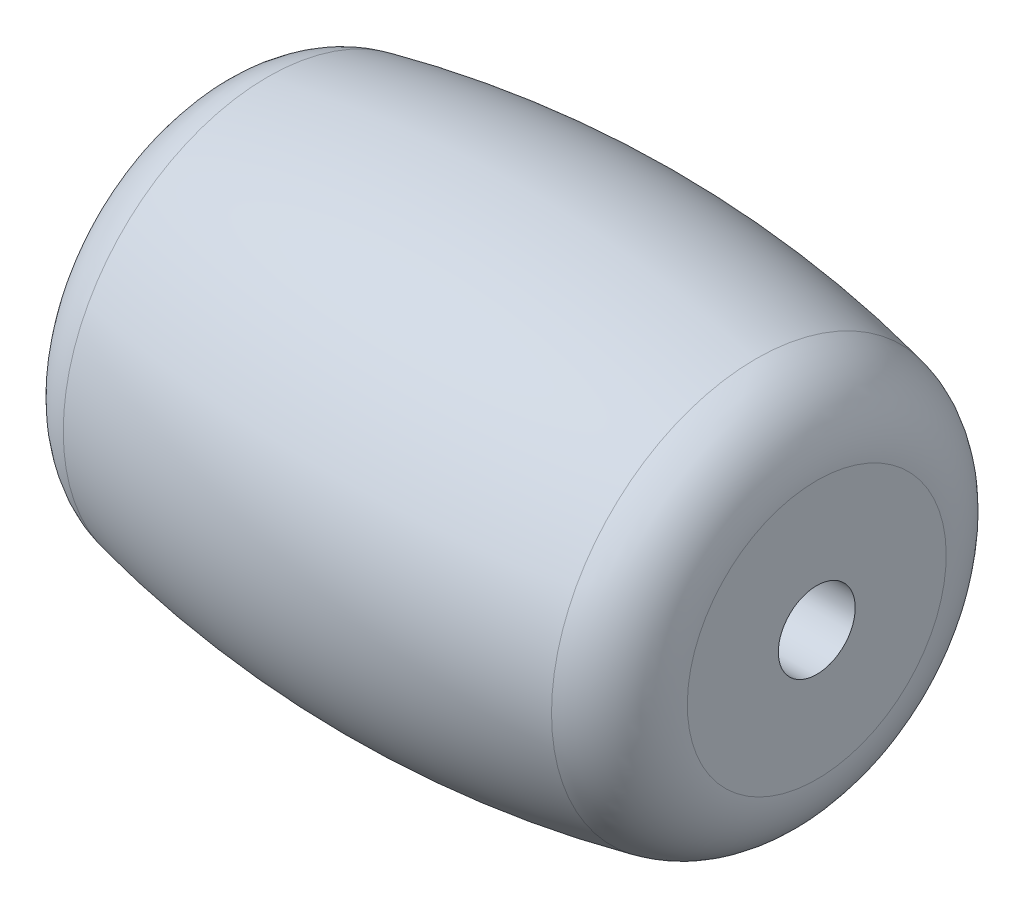
ISO-10303-21;
HEADER;
FILE_DESCRIPTION(('STEP AP214'),'2;1');
FILE_NAME('part.step','',(''),(''),'','','');
FILE_SCHEMA(('AUTOMOTIVE_DESIGN { 1 0 10303 214 1 1 1 1 }'));
ENDSEC;
DATA;
#1=APPLICATION_CONTEXT('core data for automotive mechanical design processes');
#2=APPLICATION_PROTOCOL_DEFINITION('international standard','automotive_design',2000,#1);
#3=PRODUCT_CONTEXT('',#1,'mechanical');
#4=PRODUCT('Part','Part','',(#3));
#5=PRODUCT_RELATED_PRODUCT_CATEGORY('part','',(#4));
#6=PRODUCT_DEFINITION_FORMATION('','',#4);
#7=PRODUCT_DEFINITION_CONTEXT('part definition',#1,'design');
#8=PRODUCT_DEFINITION('design','',#6,#7);
#9=PRODUCT_DEFINITION_SHAPE('','',#8);
#10=(LENGTH_UNIT() NAMED_UNIT(*) SI_UNIT(.MILLI.,.METRE.));
#11=(NAMED_UNIT(*) PLANE_ANGLE_UNIT() SI_UNIT($,.RADIAN.));
#12=(NAMED_UNIT(*) SI_UNIT($,.STERADIAN.) SOLID_ANGLE_UNIT());
#13=UNCERTAINTY_MEASURE_WITH_UNIT(LENGTH_MEASURE(1.E-05),#10,'distance_accuracy_value','');
#14=(GEOMETRIC_REPRESENTATION_CONTEXT(3) GLOBAL_UNCERTAINTY_ASSIGNED_CONTEXT((#13)) GLOBAL_UNIT_ASSIGNED_CONTEXT((#10,
#11,#12)) REPRESENTATION_CONTEXT('',''));
#15=CARTESIAN_POINT('',(0.,0.,0.));
#16=DIRECTION('',(0.,0.,1.));
#17=DIRECTION('',(1.,0.,0.));
#18=AXIS2_PLACEMENT_3D('',#15,#16,#17);
#19=CARTESIAN_POINT('',(0.,0.,0.));
#20=DIRECTION('',(-1.,0.,0.));
#21=DIRECTION('',(0.,-1.,0.));
#22=AXIS2_PLACEMENT_3D('',#19,#20,#21);
#23=DEGENERATE_TOROIDAL_SURFACE('',#22,24.,30.,.F.);
#24=CARTESIAN_POINT('',(-6.34821428571429,0.,0.));
#25=DIRECTION('',(1.,0.,0.));
#26=DIRECTION('',(0.,1.,0.));
#27=AXIS2_PLACEMENT_3D('',#24,#25,#26);
#28=CIRCLE('',#27,5.32064418430558);
#29=CARTESIAN_POINT('',(-6.34821428571429,5.32064418430558,0.));
#30=VERTEX_POINT('',#29);
#31=EDGE_CURVE('E10',#30,#30,#28,.T.);
#32=ORIENTED_EDGE('',*,*,#31,.T.);
#33=EDGE_LOOP('',(#32));
#34=FACE_BOUND('',#33,.T.);
#35=CARTESIAN_POINT('',(6.34821428571429,0.,0.));
#36=DIRECTION('',(-1.,0.,0.));
#37=DIRECTION('',(0.,-1.,0.));
#38=AXIS2_PLACEMENT_3D('',#35,#36,#37);
#39=CIRCLE('',#38,5.32064418430558);
#40=CARTESIAN_POINT('',(6.34821428571429,-5.32064418430558,0.));
#41=VERTEX_POINT('',#40);
#42=EDGE_CURVE('E45',#41,#41,#39,.T.);
#43=ORIENTED_EDGE('',*,*,#42,.T.);
#44=EDGE_LOOP('',(#43));
#45=FACE_BOUND('',#44,.T.);
#46=ADVANCED_FACE('F30',(#34,#45),#23,.F.);
#47=CARTESIAN_POINT('',(7.925,4.93431137939867,0.));
#48=DIRECTION('',(1.,0.,0.));
#49=DIRECTION('',(0.,1.,0.));
#50=AXIS2_PLACEMENT_3D('',#47,#48,#49);
#51=PLANE('',#50);
#52=CARTESIAN_POINT('',(7.925,0.,0.));
#53=DIRECTION('',(1.,0.,0.));
#54=DIRECTION('',(0.,0.,-1.));
#55=AXIS2_PLACEMENT_3D('',#52,#53,#54);
#56=CIRCLE('',#55,0.999999999999987);
#57=CARTESIAN_POINT('',(7.925,0.,-0.999999999999989));
#58=VERTEX_POINT('',#57);
#59=EDGE_CURVE('E53',#58,#58,#56,.T.);
#60=ORIENTED_EDGE('',*,*,#59,.F.);
#61=EDGE_LOOP('',(#60));
#62=FACE_BOUND('',#61,.T.);
#63=CARTESIAN_POINT('',(7.925,0.,0.));
#64=DIRECTION('',(1.,0.,0.));
#65=DIRECTION('',(0.,1.,0.));
#66=AXIS2_PLACEMENT_3D('',#63,#64,#65);
#67=CIRCLE('',#66,3.36593457201854);
#68=CARTESIAN_POINT('',(7.925,3.36593457201854,0.));
#69=VERTEX_POINT('',#68);
#70=EDGE_CURVE('E41',#69,#69,#67,.T.);
#71=ORIENTED_EDGE('',*,*,#70,.T.);
#72=EDGE_LOOP('',(#71));
#73=FACE_BOUND('',#72,.T.);
#74=ADVANCED_FACE('F59',(#62,#73),#51,.T.);
#75=CARTESIAN_POINT('',(-7.925,0.,0.));
#76=DIRECTION('',(-1.,0.,0.));
#77=DIRECTION('',(0.,-1.,0.));
#78=AXIS2_PLACEMENT_3D('',#75,#76,#77);
#79=PLANE('',#78);
#80=CARTESIAN_POINT('',(-7.925,0.,0.));
#81=DIRECTION('',(1.,0.,0.));
#82=DIRECTION('',(0.,0.,-1.));
#83=AXIS2_PLACEMENT_3D('',#80,#81,#82);
#84=CIRCLE('',#83,0.999999999999985);
#85=CARTESIAN_POINT('',(-7.925,0.,-0.999999999999987));
#86=VERTEX_POINT('',#85);
#87=EDGE_CURVE('E50',#86,#86,#84,.T.);
#88=ORIENTED_EDGE('',*,*,#87,.T.);
#89=EDGE_LOOP('',(#88));
#90=FACE_BOUND('',#89,.T.);
#91=CARTESIAN_POINT('',(-7.925,0.,0.));
#92=DIRECTION('',(-1.,0.,0.));
#93=DIRECTION('',(0.,-1.,0.));
#94=AXIS2_PLACEMENT_3D('',#91,#92,#93);
#95=CIRCLE('',#94,3.36593457201854);
#96=CARTESIAN_POINT('',(-7.925,-3.36593457201854,0.));
#97=VERTEX_POINT('',#96);
#98=EDGE_CURVE('E37',#97,#97,#95,.T.);
#99=ORIENTED_EDGE('',*,*,#98,.T.);
#100=EDGE_LOOP('',(#99));
#101=FACE_BOUND('',#100,.T.);
#102=ADVANCED_FACE('F62',(#90,#101),#79,.T.);
#103=CARTESIAN_POINT('',(5.925,0.,0.));
#104=DIRECTION('',(1.,0.,0.));
#105=DIRECTION('',(0.,1.,0.));
#106=AXIS2_PLACEMENT_3D('',#103,#104,#105);
#107=TOROIDAL_SURFACE('',#106,3.36593457201854,2.);
#108=ORIENTED_EDGE('',*,*,#70,.F.);
#109=EDGE_LOOP('',(#108));
#110=FACE_BOUND('',#109,.T.);
#111=ORIENTED_EDGE('',*,*,#42,.F.);
#112=EDGE_LOOP('',(#111));
#113=FACE_BOUND('',#112,.T.);
#114=ADVANCED_FACE('F66',(#110,#113),#107,.T.);
#115=CARTESIAN_POINT('',(-5.925,0.,0.));
#116=DIRECTION('',(-1.,0.,0.));
#117=DIRECTION('',(0.,-1.,0.));
#118=AXIS2_PLACEMENT_3D('',#115,#116,#117);
#119=TOROIDAL_SURFACE('',#118,3.36593457201854,2.);
#120=ORIENTED_EDGE('',*,*,#31,.F.);
#121=EDGE_LOOP('',(#120));
#122=FACE_BOUND('',#121,.T.);
#123=ORIENTED_EDGE('',*,*,#98,.F.);
#124=EDGE_LOOP('',(#123));
#125=FACE_BOUND('',#124,.T.);
#126=ADVANCED_FACE('F32',(#122,#125),#119,.T.);
#127=CARTESIAN_POINT('',(7.925,0.,0.));
#128=DIRECTION('',(1.,0.,0.));
#129=DIRECTION('',(0.,0.,-1.));
#130=AXIS2_PLACEMENT_3D('',#127,#128,#129);
#131=CYLINDRICAL_SURFACE('',#130,0.999999999999986);
#132=ORIENTED_EDGE('',*,*,#87,.F.);
#133=EDGE_LOOP('',(#132));
#134=FACE_BOUND('',#133,.T.);
#135=ORIENTED_EDGE('',*,*,#59,.T.);
#136=EDGE_LOOP('',(#135));
#137=FACE_BOUND('',#136,.T.);
#138=ADVANCED_FACE('F57',(#134,#137),#131,.F.);
#139=CLOSED_SHELL('',(#46,#74,#102,#114,#126,#138));
#140=MANIFOLD_SOLID_BREP('B2',#139);
#141=ADVANCED_BREP_SHAPE_REPRESENTATION('',(#18,#140),#14);
#142=SHAPE_DEFINITION_REPRESENTATION(#9,#141);
ENDSEC;
END-ISO-10303-21;
